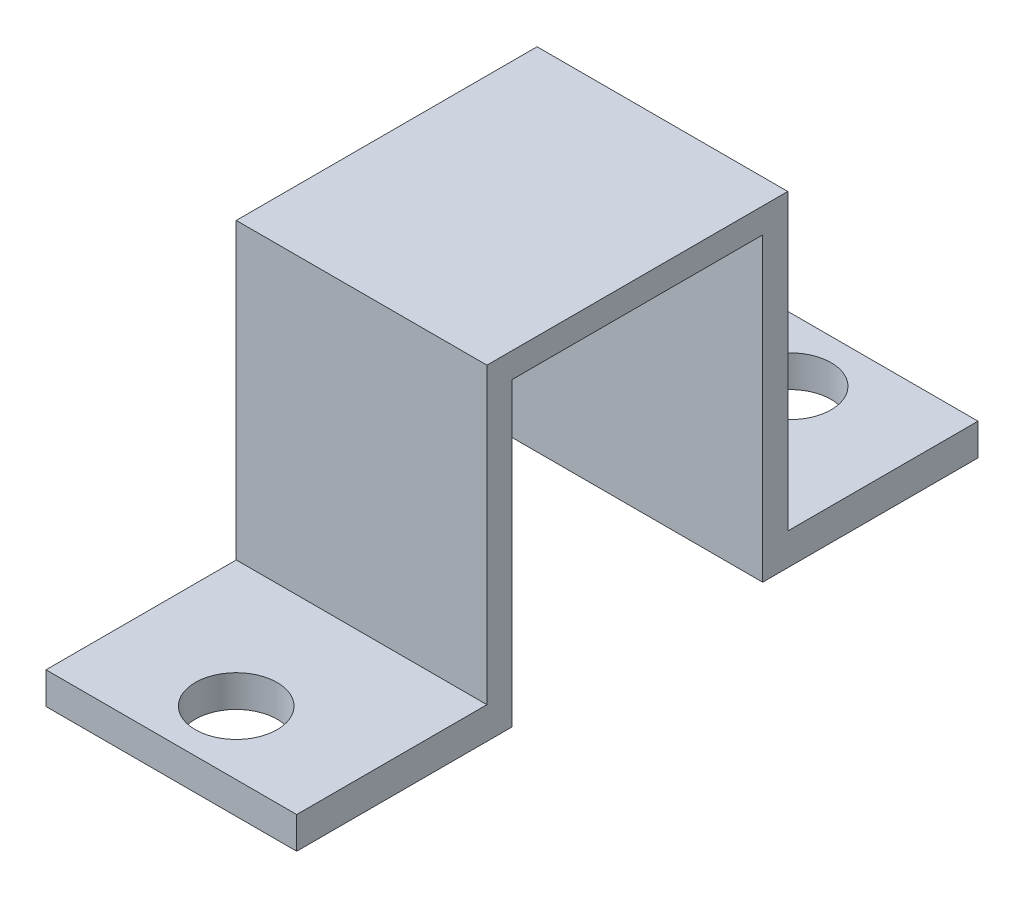
ISO-10303-21;
HEADER;
FILE_DESCRIPTION(('STEP AP214'),'2;1');
FILE_NAME('part.step','',(''),(''),'','','');
FILE_SCHEMA(('AUTOMOTIVE_DESIGN { 1 0 10303 214 1 1 1 1 }'));
ENDSEC;
DATA;
#1=APPLICATION_CONTEXT('core data for automotive mechanical design processes');
#2=APPLICATION_PROTOCOL_DEFINITION('international standard','automotive_design',2000,#1);
#3=PRODUCT_CONTEXT('',#1,'mechanical');
#4=PRODUCT('Part','Part','',(#3));
#5=PRODUCT_RELATED_PRODUCT_CATEGORY('part','',(#4));
#6=PRODUCT_DEFINITION_FORMATION('','',#4);
#7=PRODUCT_DEFINITION_CONTEXT('part definition',#1,'design');
#8=PRODUCT_DEFINITION('design','',#6,#7);
#9=PRODUCT_DEFINITION_SHAPE('','',#8);
#10=(LENGTH_UNIT() NAMED_UNIT(*) SI_UNIT(.MILLI.,.METRE.));
#11=(NAMED_UNIT(*) PLANE_ANGLE_UNIT() SI_UNIT($,.RADIAN.));
#12=(NAMED_UNIT(*) SI_UNIT($,.STERADIAN.) SOLID_ANGLE_UNIT());
#13=UNCERTAINTY_MEASURE_WITH_UNIT(LENGTH_MEASURE(1.E-05),#10,'distance_accuracy_value','');
#14=(GEOMETRIC_REPRESENTATION_CONTEXT(3) GLOBAL_UNCERTAINTY_ASSIGNED_CONTEXT((#13)) GLOBAL_UNIT_ASSIGNED_CONTEXT((#10,
#11,#12)) REPRESENTATION_CONTEXT('',''));
#15=CARTESIAN_POINT('',(0.,0.,0.));
#16=DIRECTION('',(0.,0.,1.));
#17=DIRECTION('',(1.,0.,0.));
#18=AXIS2_PLACEMENT_3D('',#15,#16,#17);
#19=CARTESIAN_POINT('',(10.,1.302,-9.828));
#20=DIRECTION('',(0.,0.,-1.));
#21=DIRECTION('',(-1.,0.,0.));
#22=AXIS2_PLACEMENT_3D('',#19,#20,#21);
#23=PLANE('',#22);
#24=DIRECTION('',(0.,-1.,0.));
#25=VECTOR('',#24,1.);
#26=CARTESIAN_POINT('',(0.,1.302,-9.828));
#27=LINE('',#26,#25);
#28=CARTESIAN_POINT('',(0.,13.032,-9.828));
#29=VERTEX_POINT('',#28);
#30=CARTESIAN_POINT('',(0.,1.302,-9.828));
#31=VERTEX_POINT('',#30);
#32=EDGE_CURVE('E156',#29,#31,#27,.T.);
#33=ORIENTED_EDGE('',*,*,#32,.T.);
#34=DIRECTION('',(-1.,0.,0.));
#35=VECTOR('',#34,1.);
#36=CARTESIAN_POINT('',(10.,1.302,-9.828));
#37=LINE('',#36,#35);
#38=CARTESIAN_POINT('',(10.,1.302,-9.828));
#39=VERTEX_POINT('',#38);
#40=EDGE_CURVE('E11',#39,#31,#37,.T.);
#41=ORIENTED_EDGE('',*,*,#40,.F.);
#42=DIRECTION('',(0.,-1.,0.));
#43=VECTOR('',#42,1.);
#44=CARTESIAN_POINT('',(10.,1.302,-9.828));
#45=LINE('',#44,#43);
#46=CARTESIAN_POINT('',(10.,13.032,-9.828));
#47=VERTEX_POINT('',#46);
#48=EDGE_CURVE('E180',#47,#39,#45,.T.);
#49=ORIENTED_EDGE('',*,*,#48,.F.);
#50=DIRECTION('',(-1.,0.,0.));
#51=VECTOR('',#50,1.);
#52=CARTESIAN_POINT('',(10.,13.032,-9.828));
#53=LINE('',#52,#51);
#54=EDGE_CURVE('E152',#47,#29,#53,.T.);
#55=ORIENTED_EDGE('',*,*,#54,.T.);
#56=EDGE_LOOP('',(#33,#41,#49,#55));
#57=FACE_BOUND('',#56,.T.);
#58=ADVANCED_FACE('F35',(#57),#23,.F.);
#59=CARTESIAN_POINT('',(10.,1.302,-2.239));
#60=DIRECTION('',(0.,-1.,0.));
#61=DIRECTION('',(0.,0.,-1.));
#62=AXIS2_PLACEMENT_3D('',#59,#60,#61);
#63=PLANE('',#62);
#64=CARTESIAN_POINT('',(5.047,1.302,-4.779));
#65=DIRECTION('',(0.,1.,0.));
#66=DIRECTION('',(0.,0.,1.));
#67=AXIS2_PLACEMENT_3D('',#64,#65,#66);
#68=CIRCLE('',#67,1.63194999999999);
#69=CARTESIAN_POINT('',(5.047,1.302,-3.14705000000002));
#70=VERTEX_POINT('',#69);
#71=EDGE_CURVE('E251',#70,#70,#68,.T.);
#72=ORIENTED_EDGE('',*,*,#71,.F.);
#73=EDGE_LOOP('',(#72));
#74=FACE_BOUND('',#73,.T.);
#75=DIRECTION('',(0.,0.,1.));
#76=VECTOR('',#75,1.);
#77=CARTESIAN_POINT('',(0.,1.302,-2.239));
#78=LINE('',#77,#76);
#79=CARTESIAN_POINT('',(0.,1.302,-2.239));
#80=VERTEX_POINT('',#79);
#81=EDGE_CURVE('E159',#31,#80,#78,.T.);
#82=ORIENTED_EDGE('',*,*,#81,.T.);
#83=DIRECTION('',(-1.,0.,0.));
#84=VECTOR('',#83,1.);
#85=CARTESIAN_POINT('',(10.,1.302,-2.239));
#86=LINE('',#85,#84);
#87=CARTESIAN_POINT('',(10.,1.302,-2.239));
#88=VERTEX_POINT('',#87);
#89=EDGE_CURVE('E43',#88,#80,#86,.T.);
#90=ORIENTED_EDGE('',*,*,#89,.F.);
#91=DIRECTION('',(0.,0.,1.));
#92=VECTOR('',#91,1.);
#93=CARTESIAN_POINT('',(10.,1.302,-2.239));
#94=LINE('',#93,#92);
#95=EDGE_CURVE('E104',#39,#88,#94,.T.);
#96=ORIENTED_EDGE('',*,*,#95,.F.);
#97=ORIENTED_EDGE('',*,*,#40,.T.);
#98=EDGE_LOOP('',(#82,#90,#96,#97));
#99=FACE_BOUND('',#98,.T.);
#100=ADVANCED_FACE('F272',(#74,#99),#63,.F.);
#101=CARTESIAN_POINT('',(10.,0.0320000000000013,-2.239));
#102=DIRECTION('',(0.,0.,-1.));
#103=DIRECTION('',(0.,1.,0.));
#104=AXIS2_PLACEMENT_3D('',#101,#102,#103);
#105=PLANE('',#104);
#106=DIRECTION('',(0.,-1.,0.));
#107=VECTOR('',#106,1.);
#108=CARTESIAN_POINT('',(0.,0.0320000000000013,-2.239));
#109=LINE('',#108,#107);
#110=CARTESIAN_POINT('',(0.,0.0320000000000013,-2.239));
#111=VERTEX_POINT('',#110);
#112=EDGE_CURVE('E162',#80,#111,#109,.T.);
#113=ORIENTED_EDGE('',*,*,#112,.T.);
#114=DIRECTION('',(-1.,0.,0.));
#115=VECTOR('',#114,1.);
#116=CARTESIAN_POINT('',(10.,0.0320000000000013,-2.239));
#117=LINE('',#116,#115);
#118=CARTESIAN_POINT('',(10.,0.0320000000000013,-2.239));
#119=VERTEX_POINT('',#118);
#120=EDGE_CURVE('E199',#119,#111,#117,.T.);
#121=ORIENTED_EDGE('',*,*,#120,.F.);
#122=DIRECTION('',(0.,-1.,0.));
#123=VECTOR('',#122,1.);
#124=CARTESIAN_POINT('',(10.,0.0320000000000013,-2.239));
#125=LINE('',#124,#123);
#126=EDGE_CURVE('E207',#88,#119,#125,.T.);
#127=ORIENTED_EDGE('',*,*,#126,.F.);
#128=ORIENTED_EDGE('',*,*,#89,.T.);
#129=EDGE_LOOP('',(#113,#121,#127,#128));
#130=FACE_BOUND('',#129,.T.);
#131=ADVANCED_FACE('F205',(#130),#105,.F.);
#132=CARTESIAN_POINT('',(10.,0.0320000000000013,-10.828));
#133=DIRECTION('',(0.,1.,0.));
#134=DIRECTION('',(0.,0.,1.));
#135=AXIS2_PLACEMENT_3D('',#132,#133,#134);
#136=PLANE('',#135);
#137=CARTESIAN_POINT('',(5.047,0.0320000000000014,-4.779));
#138=DIRECTION('',(0.,1.,0.));
#139=DIRECTION('',(0.,0.,1.));
#140=AXIS2_PLACEMENT_3D('',#137,#138,#139);
#141=CIRCLE('',#140,1.63195);
#142=CARTESIAN_POINT('',(5.047,0.0320000000000014,-3.14705));
#143=VERTEX_POINT('',#142);
#144=EDGE_CURVE('E160',#143,#143,#141,.T.);
#145=ORIENTED_EDGE('',*,*,#144,.T.);
#146=EDGE_LOOP('',(#145));
#147=FACE_BOUND('',#146,.T.);
#148=DIRECTION('',(0.,0.,-1.));
#149=VECTOR('',#148,1.);
#150=CARTESIAN_POINT('',(0.,0.0320000000000013,-10.828));
#151=LINE('',#150,#149);
#152=CARTESIAN_POINT('',(0.,0.0320000000000013,-10.828));
#153=VERTEX_POINT('',#152);
#154=EDGE_CURVE('E164',#111,#153,#151,.T.);
#155=ORIENTED_EDGE('',*,*,#154,.T.);
#156=DIRECTION('',(-1.,0.,0.));
#157=VECTOR('',#156,1.);
#158=CARTESIAN_POINT('',(10.,0.0320000000000013,-10.828));
#159=LINE('',#158,#157);
#160=CARTESIAN_POINT('',(10.,0.0320000000000013,-10.828));
#161=VERTEX_POINT('',#160);
#162=EDGE_CURVE('E196',#161,#153,#159,.T.);
#163=ORIENTED_EDGE('',*,*,#162,.F.);
#164=DIRECTION('',(0.,0.,-1.));
#165=VECTOR('',#164,1.);
#166=CARTESIAN_POINT('',(10.,0.0320000000000013,-10.828));
#167=LINE('',#166,#165);
#168=EDGE_CURVE('E223',#119,#161,#167,.T.);
#169=ORIENTED_EDGE('',*,*,#168,.F.);
#170=ORIENTED_EDGE('',*,*,#120,.T.);
#171=EDGE_LOOP('',(#155,#163,#169,#170));
#172=FACE_BOUND('',#171,.T.);
#173=ADVANCED_FACE('F214',(#147,#172),#136,.F.);
#174=CARTESIAN_POINT('',(10.,0.0320000000000013,-10.828));
#175=DIRECTION('',(0.,0.,1.));
#176=DIRECTION('',(1.,0.,0.));
#177=AXIS2_PLACEMENT_3D('',#174,#175,#176);
#178=PLANE('',#177);
#179=DIRECTION('',(0.,1.,0.));
#180=VECTOR('',#179,1.);
#181=CARTESIAN_POINT('',(0.,0.0320000000000013,-10.828));
#182=LINE('',#181,#180);
#183=CARTESIAN_POINT('',(0.,12.032,-10.828));
#184=VERTEX_POINT('',#183);
#185=EDGE_CURVE('E166',#153,#184,#182,.T.);
#186=ORIENTED_EDGE('',*,*,#185,.T.);
#187=DIRECTION('',(-1.,0.,0.));
#188=VECTOR('',#187,1.);
#189=CARTESIAN_POINT('',(10.,12.032,-10.828));
#190=LINE('',#189,#188);
#191=CARTESIAN_POINT('',(10.,12.032,-10.828));
#192=VERTEX_POINT('',#191);
#193=EDGE_CURVE('E193',#192,#184,#190,.T.);
#194=ORIENTED_EDGE('',*,*,#193,.F.);
#195=DIRECTION('',(0.,1.,0.));
#196=VECTOR('',#195,1.);
#197=CARTESIAN_POINT('',(10.,0.0320000000000013,-10.828));
#198=LINE('',#197,#196);
#199=EDGE_CURVE('E220',#161,#192,#198,.T.);
#200=ORIENTED_EDGE('',*,*,#199,.F.);
#201=ORIENTED_EDGE('',*,*,#162,.T.);
#202=EDGE_LOOP('',(#186,#194,#200,#201));
#203=FACE_BOUND('',#202,.T.);
#204=ADVANCED_FACE('F218',(#203),#178,.F.);
#205=CARTESIAN_POINT('',(10.,12.032,-10.828));
#206=DIRECTION('',(0.,1.,0.));
#207=DIRECTION('',(0.,0.,1.));
#208=AXIS2_PLACEMENT_3D('',#205,#206,#207);
#209=PLANE('',#208);
#210=DIRECTION('',(0.,0.,-1.));
#211=VECTOR('',#210,1.);
#212=CARTESIAN_POINT('',(0.,12.032,-10.828));
#213=LINE('',#212,#211);
#214=CARTESIAN_POINT('',(0.,12.032,-20.828));
#215=VERTEX_POINT('',#214);
#216=EDGE_CURVE('E168',#184,#215,#213,.T.);
#217=ORIENTED_EDGE('',*,*,#216,.T.);
#218=DIRECTION('',(-1.,0.,0.));
#219=VECTOR('',#218,1.);
#220=CARTESIAN_POINT('',(10.,12.032,-20.828));
#221=LINE('',#220,#219);
#222=CARTESIAN_POINT('',(10.,12.032,-20.828));
#223=VERTEX_POINT('',#222);
#224=EDGE_CURVE('E190',#223,#215,#221,.T.);
#225=ORIENTED_EDGE('',*,*,#224,.F.);
#226=DIRECTION('',(0.,0.,-1.));
#227=VECTOR('',#226,1.);
#228=CARTESIAN_POINT('',(10.,12.032,-10.828));
#229=LINE('',#228,#227);
#230=EDGE_CURVE('E222',#192,#223,#229,.T.);
#231=ORIENTED_EDGE('',*,*,#230,.F.);
#232=ORIENTED_EDGE('',*,*,#193,.T.);
#233=EDGE_LOOP('',(#217,#225,#231,#232));
#234=FACE_BOUND('',#233,.T.);
#235=ADVANCED_FACE('F288',(#234),#209,.F.);
#236=CARTESIAN_POINT('',(10.,12.032,-20.828));
#237=DIRECTION('',(0.,0.,-1.));
#238=DIRECTION('',(0.,1.,0.));
#239=AXIS2_PLACEMENT_3D('',#236,#237,#238);
#240=PLANE('',#239);
#241=DIRECTION('',(0.,-1.,0.));
#242=VECTOR('',#241,1.);
#243=CARTESIAN_POINT('',(0.,12.032,-20.828));
#244=LINE('',#243,#242);
#245=CARTESIAN_POINT('',(0.,0.0319999999999972,-20.828));
#246=VERTEX_POINT('',#245);
#247=EDGE_CURVE('E170',#215,#246,#244,.T.);
#248=ORIENTED_EDGE('',*,*,#247,.T.);
#249=DIRECTION('',(-1.,0.,0.));
#250=VECTOR('',#249,1.);
#251=CARTESIAN_POINT('',(10.,0.0319999999999972,-20.828));
#252=LINE('',#251,#250);
#253=CARTESIAN_POINT('',(10.,0.0319999999999972,-20.828));
#254=VERTEX_POINT('',#253);
#255=EDGE_CURVE('E187',#254,#246,#252,.T.);
#256=ORIENTED_EDGE('',*,*,#255,.F.);
#257=DIRECTION('',(0.,-1.,0.));
#258=VECTOR('',#257,1.);
#259=CARTESIAN_POINT('',(10.,12.032,-20.828));
#260=LINE('',#259,#258);
#261=EDGE_CURVE('E225',#223,#254,#260,.T.);
#262=ORIENTED_EDGE('',*,*,#261,.F.);
#263=ORIENTED_EDGE('',*,*,#224,.T.);
#264=EDGE_LOOP('',(#248,#256,#262,#263));
#265=FACE_BOUND('',#264,.T.);
#266=ADVANCED_FACE('F291',(#265),#240,.F.);
#267=CARTESIAN_POINT('',(10.,0.0319999999999972,-20.828));
#268=DIRECTION('',(0.,1.,0.));
#269=DIRECTION('',(0.,0.,1.));
#270=AXIS2_PLACEMENT_3D('',#267,#268,#269);
#271=PLANE('',#270);
#272=CARTESIAN_POINT('',(5.047,0.0319999999999973,-26.877));
#273=DIRECTION('',(0.,1.,0.));
#274=DIRECTION('',(0.,0.,1.));
#275=AXIS2_PLACEMENT_3D('',#272,#273,#274);
#276=CIRCLE('',#275,1.63195);
#277=CARTESIAN_POINT('',(5.047,0.0319999999999973,-25.24505));
#278=VERTEX_POINT('',#277);
#279=EDGE_CURVE('E254',#278,#278,#276,.T.);
#280=ORIENTED_EDGE('',*,*,#279,.T.);
#281=EDGE_LOOP('',(#280));
#282=FACE_BOUND('',#281,.T.);
#283=DIRECTION('',(0.,0.,-1.));
#284=VECTOR('',#283,1.);
#285=CARTESIAN_POINT('',(0.,0.0319999999999972,-20.828));
#286=LINE('',#285,#284);
#287=CARTESIAN_POINT('',(0.,0.0319999999999972,-29.417));
#288=VERTEX_POINT('',#287);
#289=EDGE_CURVE('E172',#246,#288,#286,.T.);
#290=ORIENTED_EDGE('',*,*,#289,.T.);
#291=DIRECTION('',(-1.,0.,0.));
#292=VECTOR('',#291,1.);
#293=CARTESIAN_POINT('',(10.,0.0319999999999972,-29.417));
#294=LINE('',#293,#292);
#295=CARTESIAN_POINT('',(10.,0.0319999999999972,-29.417));
#296=VERTEX_POINT('',#295);
#297=EDGE_CURVE('E184',#296,#288,#294,.T.);
#298=ORIENTED_EDGE('',*,*,#297,.F.);
#299=DIRECTION('',(0.,0.,-1.));
#300=VECTOR('',#299,1.);
#301=CARTESIAN_POINT('',(10.,0.0319999999999972,-20.828));
#302=LINE('',#301,#300);
#303=EDGE_CURVE('E231',#254,#296,#302,.T.);
#304=ORIENTED_EDGE('',*,*,#303,.F.);
#305=ORIENTED_EDGE('',*,*,#255,.T.);
#306=EDGE_LOOP('',(#290,#298,#304,#305));
#307=FACE_BOUND('',#306,.T.);
#308=ADVANCED_FACE('F237',(#282,#307),#271,.F.);
#309=CARTESIAN_POINT('',(10.,0.0319999999999972,-29.417));
#310=DIRECTION('',(0.,0.,1.));
#311=DIRECTION('',(0.,-1.,0.));
#312=AXIS2_PLACEMENT_3D('',#309,#310,#311);
#313=PLANE('',#312);
#314=DIRECTION('',(0.,1.,0.));
#315=VECTOR('',#314,1.);
#316=CARTESIAN_POINT('',(0.,0.0319999999999972,-29.417));
#317=LINE('',#316,#315);
#318=CARTESIAN_POINT('',(0.,1.302,-29.417));
#319=VERTEX_POINT('',#318);
#320=EDGE_CURVE('E174',#288,#319,#317,.T.);
#321=ORIENTED_EDGE('',*,*,#320,.T.);
#322=DIRECTION('',(-1.,0.,0.));
#323=VECTOR('',#322,1.);
#324=CARTESIAN_POINT('',(10.,1.302,-29.417));
#325=LINE('',#324,#323);
#326=CARTESIAN_POINT('',(10.,1.302,-29.417));
#327=VERTEX_POINT('',#326);
#328=EDGE_CURVE('E147',#327,#319,#325,.T.);
#329=ORIENTED_EDGE('',*,*,#328,.F.);
#330=DIRECTION('',(0.,1.,0.));
#331=VECTOR('',#330,1.);
#332=CARTESIAN_POINT('',(10.,0.0319999999999972,-29.417));
#333=LINE('',#332,#331);
#334=EDGE_CURVE('E136',#296,#327,#333,.T.);
#335=ORIENTED_EDGE('',*,*,#334,.F.);
#336=ORIENTED_EDGE('',*,*,#297,.T.);
#337=EDGE_LOOP('',(#321,#329,#335,#336));
#338=FACE_BOUND('',#337,.T.);
#339=ADVANCED_FACE('F241',(#338),#313,.F.);
#340=CARTESIAN_POINT('',(10.,1.302,-21.828));
#341=DIRECTION('',(0.,-1.,0.));
#342=DIRECTION('',(0.,0.,-1.));
#343=AXIS2_PLACEMENT_3D('',#340,#341,#342);
#344=PLANE('',#343);
#345=CARTESIAN_POINT('',(5.047,1.302,-26.877));
#346=DIRECTION('',(0.,1.,0.));
#347=DIRECTION('',(0.,0.,1.));
#348=AXIS2_PLACEMENT_3D('',#345,#346,#347);
#349=CIRCLE('',#348,1.63194999999999);
#350=CARTESIAN_POINT('',(5.047,1.302,-25.24505));
#351=VERTEX_POINT('',#350);
#352=EDGE_CURVE('E257',#351,#351,#349,.T.);
#353=ORIENTED_EDGE('',*,*,#352,.F.);
#354=EDGE_LOOP('',(#353));
#355=FACE_BOUND('',#354,.T.);
#356=DIRECTION('',(0.,0.,1.));
#357=VECTOR('',#356,1.);
#358=CARTESIAN_POINT('',(0.,1.302,-21.828));
#359=LINE('',#358,#357);
#360=CARTESIAN_POINT('',(0.,1.302,-21.828));
#361=VERTEX_POINT('',#360);
#362=EDGE_CURVE('E145',#319,#361,#359,.T.);
#363=ORIENTED_EDGE('',*,*,#362,.T.);
#364=DIRECTION('',(-1.,0.,0.));
#365=VECTOR('',#364,1.);
#366=CARTESIAN_POINT('',(10.,1.302,-21.828));
#367=LINE('',#366,#365);
#368=CARTESIAN_POINT('',(10.,1.302,-21.828));
#369=VERTEX_POINT('',#368);
#370=EDGE_CURVE('E142',#369,#361,#367,.T.);
#371=ORIENTED_EDGE('',*,*,#370,.F.);
#372=DIRECTION('',(0.,0.,1.));
#373=VECTOR('',#372,1.);
#374=CARTESIAN_POINT('',(10.,1.302,-21.828));
#375=LINE('',#374,#373);
#376=EDGE_CURVE('E129',#327,#369,#375,.T.);
#377=ORIENTED_EDGE('',*,*,#376,.F.);
#378=ORIENTED_EDGE('',*,*,#328,.T.);
#379=EDGE_LOOP('',(#363,#371,#377,#378));
#380=FACE_BOUND('',#379,.T.);
#381=ADVANCED_FACE('F143',(#355,#380),#344,.F.);
#382=CARTESIAN_POINT('',(10.,13.032,-21.828));
#383=DIRECTION('',(0.,0.,1.));
#384=DIRECTION('',(0.,-1.,0.));
#385=AXIS2_PLACEMENT_3D('',#382,#383,#384);
#386=PLANE('',#385);
#387=DIRECTION('',(0.,1.,0.));
#388=VECTOR('',#387,1.);
#389=CARTESIAN_POINT('',(0.,13.032,-21.828));
#390=LINE('',#389,#388);
#391=CARTESIAN_POINT('',(0.,13.032,-21.828));
#392=VERTEX_POINT('',#391);
#393=EDGE_CURVE('E177',#361,#392,#390,.T.);
#394=ORIENTED_EDGE('',*,*,#393,.T.);
#395=DIRECTION('',(-1.,0.,0.));
#396=VECTOR('',#395,1.);
#397=CARTESIAN_POINT('',(10.,13.032,-21.828));
#398=LINE('',#397,#396);
#399=CARTESIAN_POINT('',(10.,13.032,-21.828));
#400=VERTEX_POINT('',#399);
#401=EDGE_CURVE('E148',#400,#392,#398,.T.);
#402=ORIENTED_EDGE('',*,*,#401,.F.);
#403=DIRECTION('',(0.,1.,0.));
#404=VECTOR('',#403,1.);
#405=CARTESIAN_POINT('',(10.,13.032,-21.828));
#406=LINE('',#405,#404);
#407=EDGE_CURVE('E133',#369,#400,#406,.T.);
#408=ORIENTED_EDGE('',*,*,#407,.F.);
#409=ORIENTED_EDGE('',*,*,#370,.T.);
#410=EDGE_LOOP('',(#394,#402,#408,#409));
#411=FACE_BOUND('',#410,.T.);
#412=ADVANCED_FACE('F150',(#411),#386,.F.);
#413=CARTESIAN_POINT('',(10.,13.032,-9.828));
#414=DIRECTION('',(0.,-1.,0.));
#415=DIRECTION('',(0.,0.,-1.));
#416=AXIS2_PLACEMENT_3D('',#413,#414,#415);
#417=PLANE('',#416);
#418=DIRECTION('',(0.,0.,1.));
#419=VECTOR('',#418,1.);
#420=CARTESIAN_POINT('',(0.,13.032,-9.828));
#421=LINE('',#420,#419);
#422=EDGE_CURVE('E92',#392,#29,#421,.T.);
#423=ORIENTED_EDGE('',*,*,#422,.T.);
#424=ORIENTED_EDGE('',*,*,#54,.F.);
#425=DIRECTION('',(0.,0.,1.));
#426=VECTOR('',#425,1.);
#427=CARTESIAN_POINT('',(10.,13.032,-14.543));
#428=LINE('',#427,#426);
#429=EDGE_CURVE('E51',#400,#47,#428,.T.);
#430=ORIENTED_EDGE('',*,*,#429,.F.);
#431=ORIENTED_EDGE('',*,*,#401,.T.);
#432=EDGE_LOOP('',(#423,#424,#430,#431));
#433=FACE_BOUND('',#432,.T.);
#434=ADVANCED_FACE('F242',(#433),#417,.F.);
#435=CARTESIAN_POINT('',(10.,0.,0.));
#436=DIRECTION('',(-1.,0.,0.));
#437=DIRECTION('',(0.,0.,1.));
#438=AXIS2_PLACEMENT_3D('',#435,#436,#437);
#439=PLANE('',#438);
#440=ORIENTED_EDGE('',*,*,#48,.T.);
#441=ORIENTED_EDGE('',*,*,#95,.T.);
#442=ORIENTED_EDGE('',*,*,#126,.T.);
#443=ORIENTED_EDGE('',*,*,#168,.T.);
#444=ORIENTED_EDGE('',*,*,#199,.T.);
#445=ORIENTED_EDGE('',*,*,#230,.T.);
#446=ORIENTED_EDGE('',*,*,#261,.T.);
#447=ORIENTED_EDGE('',*,*,#303,.T.);
#448=ORIENTED_EDGE('',*,*,#334,.T.);
#449=ORIENTED_EDGE('',*,*,#376,.T.);
#450=ORIENTED_EDGE('',*,*,#407,.T.);
#451=ORIENTED_EDGE('',*,*,#429,.T.);
#452=EDGE_LOOP('',(#440,#441,#442,#443,#444,#445,#446,#447,#448,#449,#450,#451));
#453=FACE_BOUND('',#452,.T.);
#454=ADVANCED_FACE('F131',(#453),#439,.F.);
#455=CARTESIAN_POINT('',(0.,0.,0.));
#456=DIRECTION('',(-1.,0.,0.));
#457=DIRECTION('',(0.,0.,1.));
#458=AXIS2_PLACEMENT_3D('',#455,#456,#457);
#459=PLANE('',#458);
#460=ORIENTED_EDGE('',*,*,#32,.F.);
#461=ORIENTED_EDGE('',*,*,#422,.F.);
#462=ORIENTED_EDGE('',*,*,#393,.F.);
#463=ORIENTED_EDGE('',*,*,#362,.F.);
#464=ORIENTED_EDGE('',*,*,#320,.F.);
#465=ORIENTED_EDGE('',*,*,#289,.F.);
#466=ORIENTED_EDGE('',*,*,#247,.F.);
#467=ORIENTED_EDGE('',*,*,#216,.F.);
#468=ORIENTED_EDGE('',*,*,#185,.F.);
#469=ORIENTED_EDGE('',*,*,#154,.F.);
#470=ORIENTED_EDGE('',*,*,#112,.F.);
#471=ORIENTED_EDGE('',*,*,#81,.F.);
#472=EDGE_LOOP('',(#460,#461,#462,#463,#464,#465,#466,#467,#468,#469,#470,#471));
#473=FACE_BOUND('',#472,.T.);
#474=ADVANCED_FACE('F209',(#473),#459,.T.);
#475=CARTESIAN_POINT('',(5.047,1.302,-4.779));
#476=DIRECTION('',(0.,1.,0.));
#477=DIRECTION('',(0.,0.,1.));
#478=AXIS2_PLACEMENT_3D('',#475,#476,#477);
#479=CYLINDRICAL_SURFACE('',#478,1.63194999999999);
#480=ORIENTED_EDGE('',*,*,#144,.F.);
#481=EDGE_LOOP('',(#480));
#482=FACE_BOUND('',#481,.T.);
#483=ORIENTED_EDGE('',*,*,#71,.T.);
#484=EDGE_LOOP('',(#483));
#485=FACE_BOUND('',#484,.T.);
#486=ADVANCED_FACE('F303',(#482,#485),#479,.F.);
#487=CARTESIAN_POINT('',(5.047,1.302,-26.877));
#488=DIRECTION('',(0.,1.,0.));
#489=DIRECTION('',(0.,0.,1.));
#490=AXIS2_PLACEMENT_3D('',#487,#488,#489);
#491=CYLINDRICAL_SURFACE('',#490,1.63194999999999);
#492=ORIENTED_EDGE('',*,*,#279,.F.);
#493=EDGE_LOOP('',(#492));
#494=FACE_BOUND('',#493,.T.);
#495=ORIENTED_EDGE('',*,*,#352,.T.);
#496=EDGE_LOOP('',(#495));
#497=FACE_BOUND('',#496,.T.);
#498=ADVANCED_FACE('F261',(#494,#497),#491,.F.);
#499=CLOSED_SHELL('',(#58,#100,#131,#173,#204,#235,#266,#308,#339,#381,#412,#434,#454,#474,#486,#498));
#500=MANIFOLD_SOLID_BREP('B2',#499);
#501=ADVANCED_BREP_SHAPE_REPRESENTATION('',(#18,#500),#14);
#502=SHAPE_DEFINITION_REPRESENTATION(#9,#501);
ENDSEC;
END-ISO-10303-21;
